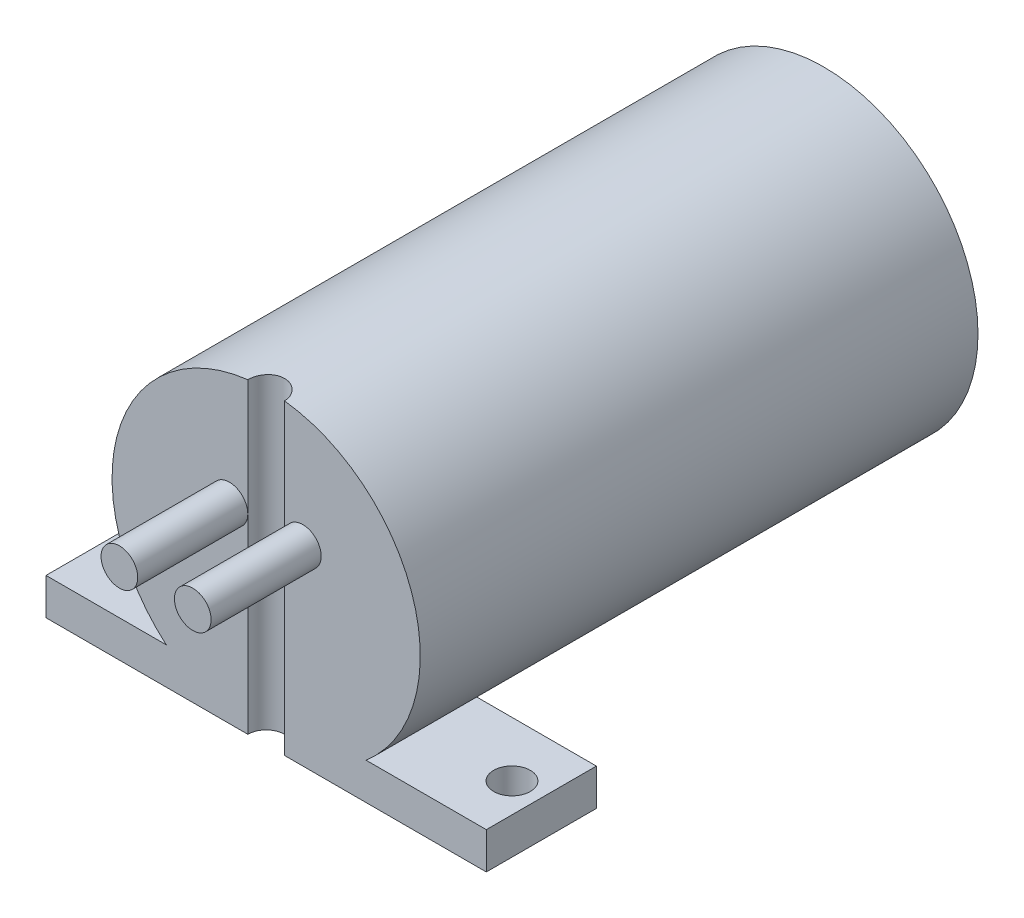
ISO-10303-21;
HEADER;
FILE_DESCRIPTION(('STEP AP214'),'2;1');
FILE_NAME('part.step','',(''),(''),'','','');
FILE_SCHEMA(('AUTOMOTIVE_DESIGN { 1 0 10303 214 1 1 1 1 }'));
ENDSEC;
DATA;
#1=APPLICATION_CONTEXT('core data for automotive mechanical design processes');
#2=APPLICATION_PROTOCOL_DEFINITION('international standard','automotive_design',2000,#1);
#3=PRODUCT_CONTEXT('',#1,'mechanical');
#4=PRODUCT('Part','Part','',(#3));
#5=PRODUCT_RELATED_PRODUCT_CATEGORY('part','',(#4));
#6=PRODUCT_DEFINITION_FORMATION('','',#4);
#7=PRODUCT_DEFINITION_CONTEXT('part definition',#1,'design');
#8=PRODUCT_DEFINITION('design','',#6,#7);
#9=PRODUCT_DEFINITION_SHAPE('','',#8);
#10=(LENGTH_UNIT() NAMED_UNIT(*) SI_UNIT(.MILLI.,.METRE.));
#11=(NAMED_UNIT(*) PLANE_ANGLE_UNIT() SI_UNIT($,.RADIAN.));
#12=(NAMED_UNIT(*) SI_UNIT($,.STERADIAN.) SOLID_ANGLE_UNIT());
#13=UNCERTAINTY_MEASURE_WITH_UNIT(LENGTH_MEASURE(1.E-05),#10,'distance_accuracy_value','');
#14=(GEOMETRIC_REPRESENTATION_CONTEXT(3) GLOBAL_UNCERTAINTY_ASSIGNED_CONTEXT((#13)) GLOBAL_UNIT_ASSIGNED_CONTEXT((#10,
#11,#12)) REPRESENTATION_CONTEXT('',''));
#15=CARTESIAN_POINT('',(0.,0.,0.));
#16=DIRECTION('',(0.,0.,1.));
#17=DIRECTION('',(1.,0.,0.));
#18=AXIS2_PLACEMENT_3D('',#15,#16,#17);
#19=CARTESIAN_POINT('',(0.,0.,48.26));
#20=DIRECTION('',(0.,0.,1.));
#21=DIRECTION('',(1.,0.,0.));
#22=AXIS2_PLACEMENT_3D('',#19,#20,#21);
#23=PLANE('',#22);
#24=DIRECTION('',(0.,-1.,0.));
#25=VECTOR('',#24,1.);
#26=CARTESIAN_POINT('',(-1.5875,-13.335,48.26));
#27=LINE('',#26,#25);
#28=CARTESIAN_POINT('',(-1.5875,3.175,48.26));
#29=VERTEX_POINT('',#28);
#30=CARTESIAN_POINT('',(-1.5875,-13.335,48.26));
#31=VERTEX_POINT('',#30);
#32=EDGE_CURVE('E126',#29,#31,#27,.T.);
#33=ORIENTED_EDGE('',*,*,#32,.F.);
#34=CARTESIAN_POINT('',(-3.175,3.175,48.26));
#35=DIRECTION('',(0.,0.,1.));
#36=DIRECTION('',(1.,0.,0.));
#37=AXIS2_PLACEMENT_3D('',#34,#35,#36);
#38=CIRCLE('',#37,1.5875);
#39=EDGE_CURVE('E66',#29,#29,#38,.T.);
#40=ORIENTED_EDGE('',*,*,#39,.F.);
#41=CARTESIAN_POINT('',(-1.5875,13.2401687583656,48.26));
#42=VERTEX_POINT('',#41);
#43=EDGE_CURVE('E214',#42,#29,#27,.T.);
#44=ORIENTED_EDGE('',*,*,#43,.F.);
#45=CARTESIAN_POINT('',(0.,0.,48.26));
#46=DIRECTION('',(0.,0.,1.));
#47=DIRECTION('',(1.,0.,0.));
#48=AXIS2_PLACEMENT_3D('',#45,#46,#47);
#49=CIRCLE('',#48,13.335);
#50=CARTESIAN_POINT('',(-8.63693377304701,-10.16,48.26));
#51=VERTEX_POINT('',#50);
#52=EDGE_CURVE('E178',#42,#51,#49,.T.);
#53=ORIENTED_EDGE('',*,*,#52,.T.);
#54=DIRECTION('',(-1.,0.,0.));
#55=VECTOR('',#54,1.);
#56=CARTESIAN_POINT('',(19.05,-10.16,48.26));
#57=LINE('',#56,#55);
#58=CARTESIAN_POINT('',(-19.05,-10.16,48.26));
#59=VERTEX_POINT('',#58);
#60=EDGE_CURVE('E211',#51,#59,#57,.T.);
#61=ORIENTED_EDGE('',*,*,#60,.T.);
#62=DIRECTION('',(0.,-1.,0.));
#63=VECTOR('',#62,1.);
#64=CARTESIAN_POINT('',(-19.05,-10.16,48.26));
#65=LINE('',#64,#63);
#66=CARTESIAN_POINT('',(-19.05,-13.335,48.26));
#67=VERTEX_POINT('',#66);
#68=EDGE_CURVE('E162',#59,#67,#65,.T.);
#69=ORIENTED_EDGE('',*,*,#68,.T.);
#70=DIRECTION('',(-1.,0.,0.));
#71=VECTOR('',#70,1.);
#72=CARTESIAN_POINT('',(19.05,-13.335,48.26));
#73=LINE('',#72,#71);
#74=EDGE_CURVE('E144',#31,#67,#73,.T.);
#75=ORIENTED_EDGE('',*,*,#74,.F.);
#76=EDGE_LOOP('',(#33,#40,#44,#53,#61,#69,#75));
#77=FACE_BOUND('',#76,.T.);
#78=ADVANCED_FACE('F42',(#77),#23,.T.);
#79=CARTESIAN_POINT('',(0.,0.,48.26));
#80=DIRECTION('',(0.,0.,-1.));
#81=DIRECTION('',(-1.,0.,0.));
#82=AXIS2_PLACEMENT_3D('',#79,#80,#81);
#83=CYLINDRICAL_SURFACE('',#82,13.335);
#84=CARTESIAN_POINT('',(0.,0.,0.));
#85=DIRECTION('',(0.,0.,1.));
#86=DIRECTION('',(1.,0.,0.));
#87=AXIS2_PLACEMENT_3D('',#84,#85,#86);
#88=CIRCLE('',#87,13.335);
#89=CARTESIAN_POINT('',(13.335,0.,0.));
#90=VERTEX_POINT('',#89);
#91=EDGE_CURVE('E173',#90,#90,#88,.T.);
#92=ORIENTED_EDGE('',*,*,#91,.T.);
#93=EDGE_LOOP('',(#92));
#94=FACE_BOUND('',#93,.T.);
#95=ORIENTED_EDGE('',*,*,#52,.F.);
#96=CARTESIAN_POINT('',(-1.5875,13.2401687583656,48.26));
#97=CARTESIAN_POINT('',(-1.58749989083105,13.2401674685661,48.2155057282806));
#98=CARTESIAN_POINT('',(-1.5856282009014,13.2403933321704,48.1710329281723));
#99=CARTESIAN_POINT('',(-1.57816250280456,13.2412857759808,48.0824086676028));
#100=CARTESIAN_POINT('',(-1.57256877106278,13.2419523234587,48.0382571835246));
#101=CARTESIAN_POINT('',(-1.55026333299539,13.2445893534873,47.9068571221025));
#102=CARTESIAN_POINT('',(-1.52802720167712,13.2471973238106,47.8204936604794));
#103=CARTESIAN_POINT('',(-1.46946299632564,13.2538206284328,47.6527601801473));
#104=CARTESIAN_POINT('',(-1.43312987558435,13.2578364666972,47.571391961827));
#105=CARTESIAN_POINT('',(-1.34741828469973,13.2668209661558,47.4159055459649));
#106=CARTESIAN_POINT('',(-1.29804152728852,13.2717895022297,47.3417863983126));
#107=CARTESIAN_POINT('',(-1.18738774473177,13.2821469538671,47.2025449805401));
#108=CARTESIAN_POINT('',(-1.12605983210618,13.2875376058939,47.1374632961336));
#109=CARTESIAN_POINT('',(-0.993327444953107,13.2981182551827,47.0184676334473));
#110=CARTESIAN_POINT('',(-0.921919201485522,13.3033081764647,46.9645578509275));
#111=CARTESIAN_POINT('',(-0.770783997254712,13.3129210064523,46.8692960262462));
#112=CARTESIAN_POINT('',(-0.691029569665693,13.3173412464321,46.8279873178981));
#113=CARTESIAN_POINT('',(-0.525714812640787,13.3248890126384,46.7594100599751));
#114=CARTESIAN_POINT('',(-0.440161403842763,13.3280180492601,46.7321250967856));
#115=CARTESIAN_POINT('',(-0.295119233540965,13.3318601705261,46.6990424226554));
#116=CARTESIAN_POINT('',(-0.236553688167421,13.333031979586,46.6891031397442));
#117=CARTESIAN_POINT('',(-0.118667266617829,13.3346023000691,46.675830605281));
#118=CARTESIAN_POINT('',(-0.0593463796710852,13.3350008004529,46.6724974480345));
#119=CARTESIAN_POINT('',(0.0888331150822678,13.3349988018355,46.6725038199304));
#120=CARTESIAN_POINT('',(0.177723348766857,13.3341029364165,46.6799815781257));
#121=CARTESIAN_POINT('',(0.353032014445846,13.3306153030461,46.7096951525648));
#122=CARTESIAN_POINT('',(0.439447734629815,13.3280217436518,46.7319465586325));
#123=CARTESIAN_POINT('',(0.607244076189092,13.3214310885218,46.7905442653409));
#124=CARTESIAN_POINT('',(0.688627989764798,13.3174349221591,46.8268812344913));
#125=CARTESIAN_POINT('',(0.844127603822901,13.3084840345293,46.9125998768801));
#126=CARTESIAN_POINT('',(0.918244482860676,13.3035294690826,46.9619794300799));
#127=CARTESIAN_POINT('',(1.05749034125783,13.2931878485457,47.0726439265578));
#128=CARTESIAN_POINT('',(1.12257789971178,13.2877989687185,47.1339808199378));
#129=CARTESIAN_POINT('',(1.24156392875665,13.2772106005854,47.2667130637143));
#130=CARTESIAN_POINT('',(1.29546140962365,13.2720111290655,47.3381093028885));
#131=CARTESIAN_POINT('',(1.39069782547778,13.262371257651,47.489208309109));
#132=CARTESIAN_POINT('',(1.43199490210773,13.2579334087616,47.568937605947));
#133=CARTESIAN_POINT('',(1.50057954170716,13.2503465641544,47.7342501066289));
#134=CARTESIAN_POINT('',(1.52787494379432,13.2471968474508,47.8198300044127));
#135=CARTESIAN_POINT('',(1.56096893001503,13.2433295522576,47.9649363651862));
#136=CARTESIAN_POINT('',(1.57091049358061,13.2421502067719,48.0235392030158));
#137=CARTESIAN_POINT('',(1.58417597724548,13.2405673548395,48.141419456559));
#138=CARTESIAN_POINT('',(1.58750875750055,13.2401628096711,48.2006958618031));
#139=CARTESIAN_POINT('',(1.5875,13.2401687583656,48.26));
#140=B_SPLINE_CURVE_WITH_KNOTS('',3,(#96,#97,#98,#99,#100,#101,#102,#103,#104,#105,#106,#107,
#108,#109,#110,#111,#112,#113,#114,#115,#116,#117,#118,#119,#120,#121,#122,#123,#124,#125,#126,
#127,#128,#129,#130,#131,#132,#133,#134,#135,#136,#137,#138,#139),.UNSPECIFIED.,.F.,.F.,(4,2,2,
2,2,2,2,2,2,2,2,2,2,2,2,2,2,2,2,2,2,4),(0.,0.133400329544741,0.266790752933609,
0.533070274071651,0.799445211100431,1.06578518837492,1.33328503665713,1.60088516681011,
1.86939543347101,2.13759071166709,2.31548243795509,2.49337670371433,2.75965919424282,
3.02622312569289,3.29261076321044,3.55895512672275,3.82648353693555,4.09403559904634,
4.36246702374168,4.63074799725293,4.80875070859316,4.98651461638341),.UNSPECIFIED.);
#141=CARTESIAN_POINT('',(1.5875,13.2401687583656,48.26));
#142=VERTEX_POINT('',#141);
#143=EDGE_CURVE('E11',#42,#142,#140,.T.);
#144=ORIENTED_EDGE('',*,*,#143,.T.);
#145=CARTESIAN_POINT('',(8.63693377304701,-10.16,48.26));
#146=VERTEX_POINT('',#145);
#147=EDGE_CURVE('E174',#146,#142,#49,.T.);
#148=ORIENTED_EDGE('',*,*,#147,.F.);
#149=DIRECTION('',(0.,0.,-1.));
#150=VECTOR('',#149,1.);
#151=CARTESIAN_POINT('',(8.63693377304701,-10.16,48.26));
#152=LINE('',#151,#150);
#153=CARTESIAN_POINT('',(8.63693377304701,-10.16,38.735));
#154=VERTEX_POINT('',#153);
#155=EDGE_CURVE('E159',#154,#146,#152,.F.);
#156=ORIENTED_EDGE('',*,*,#155,.F.);
#157=CARTESIAN_POINT('',(0.,0.,38.735));
#158=DIRECTION('',(0.,0.,-1.));
#159=DIRECTION('',(-1.,0.,0.));
#160=AXIS2_PLACEMENT_3D('',#157,#158,#159);
#161=CIRCLE('',#160,13.335);
#162=CARTESIAN_POINT('',(0.,-13.335,38.735));
#163=VERTEX_POINT('',#162);
#164=EDGE_CURVE('E56',#154,#163,#161,.T.);
#165=ORIENTED_EDGE('',*,*,#164,.T.);
#166=CARTESIAN_POINT('',(-8.63693377304701,-10.16,38.735));
#167=VERTEX_POINT('',#166);
#168=EDGE_CURVE('E177',#163,#167,#161,.T.);
#169=ORIENTED_EDGE('',*,*,#168,.T.);
#170=DIRECTION('',(0.,0.,-1.));
#171=VECTOR('',#170,1.);
#172=CARTESIAN_POINT('',(-8.63693377304701,-10.16,48.26));
#173=LINE('',#172,#171);
#174=EDGE_CURVE('E170',#51,#167,#173,.T.);
#175=ORIENTED_EDGE('',*,*,#174,.F.);
#176=EDGE_LOOP('',(#95,#144,#148,#156,#165,#169,#175));
#177=FACE_BOUND('',#176,.T.);
#178=ADVANCED_FACE('F44',(#94,#177),#83,.T.);
#179=DIRECTION('',(0.,-1.,0.));
#180=VECTOR('',#179,1.);
#181=CARTESIAN_POINT('',(1.5875,-13.335,48.26));
#182=LINE('',#181,#180);
#183=CARTESIAN_POINT('',(1.5875,3.175,48.26));
#184=VERTEX_POINT('',#183);
#185=EDGE_CURVE('E130',#184,#142,#182,.F.);
#186=ORIENTED_EDGE('',*,*,#185,.F.);
#187=CARTESIAN_POINT('',(3.175,3.175,48.26));
#188=DIRECTION('',(0.,0.,1.));
#189=DIRECTION('',(1.,0.,0.));
#190=AXIS2_PLACEMENT_3D('',#187,#188,#189);
#191=CIRCLE('',#190,1.5875);
#192=EDGE_CURVE('E61',#184,#184,#191,.T.);
#193=ORIENTED_EDGE('',*,*,#192,.F.);
#194=CARTESIAN_POINT('',(1.5875,-13.335,48.26));
#195=VERTEX_POINT('',#194);
#196=EDGE_CURVE('E124',#195,#184,#182,.F.);
#197=ORIENTED_EDGE('',*,*,#196,.F.);
#198=CARTESIAN_POINT('',(19.05,-13.335,48.26));
#199=VERTEX_POINT('',#198);
#200=EDGE_CURVE('E136',#199,#195,#73,.T.);
#201=ORIENTED_EDGE('',*,*,#200,.F.);
#202=DIRECTION('',(0.,-1.,0.));
#203=VECTOR('',#202,1.);
#204=CARTESIAN_POINT('',(19.05,-10.16,48.26));
#205=LINE('',#204,#203);
#206=CARTESIAN_POINT('',(19.05,-10.16,48.26));
#207=VERTEX_POINT('',#206);
#208=EDGE_CURVE('E165',#207,#199,#205,.T.);
#209=ORIENTED_EDGE('',*,*,#208,.F.);
#210=EDGE_CURVE('E205',#207,#146,#57,.T.);
#211=ORIENTED_EDGE('',*,*,#210,.T.);
#212=ORIENTED_EDGE('',*,*,#147,.T.);
#213=EDGE_LOOP('',(#186,#193,#197,#201,#209,#211,#212));
#214=FACE_BOUND('',#213,.T.);
#215=ADVANCED_FACE('F135',(#214),#23,.T.);
#216=CARTESIAN_POINT('',(0.,0.,0.));
#217=DIRECTION('',(0.,0.,1.));
#218=DIRECTION('',(1.,0.,0.));
#219=AXIS2_PLACEMENT_3D('',#216,#217,#218);
#220=PLANE('',#219);
#221=ORIENTED_EDGE('',*,*,#91,.F.);
#222=EDGE_LOOP('',(#221));
#223=FACE_BOUND('',#222,.T.);
#224=ADVANCED_FACE('F261',(#223),#220,.F.);
#225=CARTESIAN_POINT('',(19.05,-10.16,38.735));
#226=DIRECTION('',(0.,0.,-1.));
#227=DIRECTION('',(-1.,0.,0.));
#228=AXIS2_PLACEMENT_3D('',#225,#226,#227);
#229=PLANE('',#228);
#230=ORIENTED_EDGE('',*,*,#164,.F.);
#231=DIRECTION('',(1.,0.,0.));
#232=VECTOR('',#231,1.);
#233=CARTESIAN_POINT('',(19.05,-10.16,38.735));
#234=LINE('',#233,#232);
#235=CARTESIAN_POINT('',(19.05,-10.16,38.735));
#236=VERTEX_POINT('',#235);
#237=EDGE_CURVE('E204',#154,#236,#234,.T.);
#238=ORIENTED_EDGE('',*,*,#237,.T.);
#239=DIRECTION('',(0.,-1.,0.));
#240=VECTOR('',#239,1.);
#241=CARTESIAN_POINT('',(19.05,-10.16,38.735));
#242=LINE('',#241,#240);
#243=CARTESIAN_POINT('',(19.05,-13.335,38.735));
#244=VERTEX_POINT('',#243);
#245=EDGE_CURVE('E156',#236,#244,#242,.T.);
#246=ORIENTED_EDGE('',*,*,#245,.T.);
#247=DIRECTION('',(1.,0.,0.));
#248=VECTOR('',#247,1.);
#249=CARTESIAN_POINT('',(19.05,-13.335,38.735));
#250=LINE('',#249,#248);
#251=EDGE_CURVE('E147',#163,#244,#250,.T.);
#252=ORIENTED_EDGE('',*,*,#251,.F.);
#253=EDGE_LOOP('',(#230,#238,#246,#252));
#254=FACE_BOUND('',#253,.T.);
#255=ADVANCED_FACE('F193',(#254),#229,.T.);
#256=CARTESIAN_POINT('',(0.,-10.16,0.));
#257=DIRECTION('',(0.,-1.,0.));
#258=DIRECTION('',(0.,0.,-1.));
#259=AXIS2_PLACEMENT_3D('',#256,#257,#258);
#260=PLANE('',#259);
#261=CARTESIAN_POINT('',(-16.51,-10.16,43.4975));
#262=DIRECTION('',(0.,-1.,0.));
#263=DIRECTION('',(0.,0.,-1.));
#264=AXIS2_PLACEMENT_3D('',#261,#262,#263);
#265=CIRCLE('',#264,1.5875);
#266=CARTESIAN_POINT('',(-16.51,-10.16,41.91));
#267=VERTEX_POINT('',#266);
#268=EDGE_CURVE('E131',#267,#267,#265,.T.);
#269=ORIENTED_EDGE('',*,*,#268,.T.);
#270=EDGE_LOOP('',(#269));
#271=FACE_BOUND('',#270,.T.);
#272=ORIENTED_EDGE('',*,*,#60,.F.);
#273=ORIENTED_EDGE('',*,*,#174,.T.);
#274=CARTESIAN_POINT('',(-19.05,-10.16,38.735));
#275=VERTEX_POINT('',#274);
#276=EDGE_CURVE('E167',#275,#167,#234,.T.);
#277=ORIENTED_EDGE('',*,*,#276,.F.);
#278=DIRECTION('',(0.,0.,-1.));
#279=VECTOR('',#278,1.);
#280=CARTESIAN_POINT('',(-19.05,-10.16,38.735));
#281=LINE('',#280,#279);
#282=EDGE_CURVE('E201',#59,#275,#281,.T.);
#283=ORIENTED_EDGE('',*,*,#282,.F.);
#284=EDGE_LOOP('',(#272,#273,#277,#283));
#285=FACE_BOUND('',#284,.T.);
#286=ADVANCED_FACE('F207',(#271,#285),#260,.F.);
#287=CARTESIAN_POINT('',(16.51,-10.16,43.4975));
#288=DIRECTION('',(0.,-1.,0.));
#289=DIRECTION('',(0.,0.,-1.));
#290=AXIS2_PLACEMENT_3D('',#287,#288,#289);
#291=CIRCLE('',#290,1.5875);
#292=CARTESIAN_POINT('',(16.51,-10.16,41.91));
#293=VERTEX_POINT('',#292);
#294=EDGE_CURVE('E221',#293,#293,#291,.T.);
#295=ORIENTED_EDGE('',*,*,#294,.T.);
#296=EDGE_LOOP('',(#295));
#297=FACE_BOUND('',#296,.T.);
#298=ORIENTED_EDGE('',*,*,#237,.F.);
#299=ORIENTED_EDGE('',*,*,#155,.T.);
#300=ORIENTED_EDGE('',*,*,#210,.F.);
#301=DIRECTION('',(0.,0.,1.));
#302=VECTOR('',#301,1.);
#303=CARTESIAN_POINT('',(19.05,-10.16,38.735));
#304=LINE('',#303,#302);
#305=EDGE_CURVE('E155',#236,#207,#304,.T.);
#306=ORIENTED_EDGE('',*,*,#305,.F.);
#307=EDGE_LOOP('',(#298,#299,#300,#306));
#308=FACE_BOUND('',#307,.T.);
#309=ADVANCED_FACE('F276',(#297,#308),#260,.F.);
#310=CARTESIAN_POINT('',(0.,-13.335,0.));
#311=DIRECTION('',(0.,-1.,0.));
#312=DIRECTION('',(0.,0.,-1.));
#313=AXIS2_PLACEMENT_3D('',#310,#311,#312);
#314=PLANE('',#313);
#315=CARTESIAN_POINT('',(16.51,-13.335,43.4975));
#316=DIRECTION('',(0.,-1.,0.));
#317=DIRECTION('',(0.,0.,-1.));
#318=AXIS2_PLACEMENT_3D('',#315,#316,#317);
#319=CIRCLE('',#318,1.5875);
#320=CARTESIAN_POINT('',(16.51,-13.335,41.91));
#321=VERTEX_POINT('',#320);
#322=EDGE_CURVE('E224',#321,#321,#319,.T.);
#323=ORIENTED_EDGE('',*,*,#322,.F.);
#324=EDGE_LOOP('',(#323));
#325=FACE_BOUND('',#324,.T.);
#326=CARTESIAN_POINT('',(-16.51,-13.335,43.4975));
#327=DIRECTION('',(0.,-1.,0.));
#328=DIRECTION('',(0.,0.,-1.));
#329=AXIS2_PLACEMENT_3D('',#326,#327,#328);
#330=CIRCLE('',#329,1.5875);
#331=CARTESIAN_POINT('',(-16.51,-13.335,41.91));
#332=VERTEX_POINT('',#331);
#333=EDGE_CURVE('E218',#332,#332,#330,.T.);
#334=ORIENTED_EDGE('',*,*,#333,.F.);
#335=EDGE_LOOP('',(#334));
#336=FACE_BOUND('',#335,.T.);
#337=CARTESIAN_POINT('',(0.,-13.335,48.26));
#338=DIRECTION('',(0.,-1.,0.));
#339=DIRECTION('',(0.,0.,-1.));
#340=AXIS2_PLACEMENT_3D('',#337,#338,#339);
#341=CIRCLE('',#340,1.5875);
#342=EDGE_CURVE('E120',#31,#195,#341,.T.);
#343=ORIENTED_EDGE('',*,*,#342,.F.);
#344=ORIENTED_EDGE('',*,*,#74,.T.);
#345=DIRECTION('',(0.,0.,-1.));
#346=VECTOR('',#345,1.);
#347=CARTESIAN_POINT('',(-19.05,-13.335,38.735));
#348=LINE('',#347,#346);
#349=CARTESIAN_POINT('',(-19.05,-13.335,38.735));
#350=VERTEX_POINT('',#349);
#351=EDGE_CURVE('E143',#67,#350,#348,.T.);
#352=ORIENTED_EDGE('',*,*,#351,.T.);
#353=EDGE_CURVE('E152',#350,#163,#250,.T.);
#354=ORIENTED_EDGE('',*,*,#353,.T.);
#355=ORIENTED_EDGE('',*,*,#251,.T.);
#356=DIRECTION('',(0.,0.,1.));
#357=VECTOR('',#356,1.);
#358=CARTESIAN_POINT('',(19.05,-13.335,38.735));
#359=LINE('',#358,#357);
#360=EDGE_CURVE('E142',#244,#199,#359,.T.);
#361=ORIENTED_EDGE('',*,*,#360,.T.);
#362=ORIENTED_EDGE('',*,*,#200,.T.);
#363=EDGE_LOOP('',(#343,#344,#352,#354,#355,#361,#362));
#364=FACE_BOUND('',#363,.T.);
#365=ADVANCED_FACE('F140',(#325,#336,#364),#314,.T.);
#366=CARTESIAN_POINT('',(19.05,-10.16,38.735));
#367=DIRECTION('',(1.,0.,0.));
#368=DIRECTION('',(0.,0.,-1.));
#369=AXIS2_PLACEMENT_3D('',#366,#367,#368);
#370=PLANE('',#369);
#371=ORIENTED_EDGE('',*,*,#360,.F.);
#372=ORIENTED_EDGE('',*,*,#245,.F.);
#373=ORIENTED_EDGE('',*,*,#305,.T.);
#374=ORIENTED_EDGE('',*,*,#208,.T.);
#375=EDGE_LOOP('',(#371,#372,#373,#374));
#376=FACE_BOUND('',#375,.T.);
#377=ADVANCED_FACE('F282',(#376),#370,.T.);
#378=ORIENTED_EDGE('',*,*,#168,.F.);
#379=ORIENTED_EDGE('',*,*,#353,.F.);
#380=DIRECTION('',(0.,-1.,0.));
#381=VECTOR('',#380,1.);
#382=CARTESIAN_POINT('',(-19.05,-10.16,38.735));
#383=LINE('',#382,#381);
#384=EDGE_CURVE('E160',#275,#350,#383,.T.);
#385=ORIENTED_EDGE('',*,*,#384,.F.);
#386=ORIENTED_EDGE('',*,*,#276,.T.);
#387=EDGE_LOOP('',(#378,#379,#385,#386));
#388=FACE_BOUND('',#387,.T.);
#389=ADVANCED_FACE('F191',(#388),#229,.T.);
#390=CARTESIAN_POINT('',(-19.05,-10.16,38.735));
#391=DIRECTION('',(-1.,0.,0.));
#392=DIRECTION('',(0.,0.,1.));
#393=AXIS2_PLACEMENT_3D('',#390,#391,#392);
#394=PLANE('',#393);
#395=ORIENTED_EDGE('',*,*,#351,.F.);
#396=ORIENTED_EDGE('',*,*,#68,.F.);
#397=ORIENTED_EDGE('',*,*,#282,.T.);
#398=ORIENTED_EDGE('',*,*,#384,.T.);
#399=EDGE_LOOP('',(#395,#396,#397,#398));
#400=FACE_BOUND('',#399,.T.);
#401=ADVANCED_FACE('F198',(#400),#394,.T.);
#402=CARTESIAN_POINT('',(0.,-13.335,48.26));
#403=DIRECTION('',(0.,-1.,0.));
#404=DIRECTION('',(0.,0.,-1.));
#405=AXIS2_PLACEMENT_3D('',#402,#403,#404);
#406=CYLINDRICAL_SURFACE('',#405,1.5875);
#407=ORIENTED_EDGE('',*,*,#43,.T.);
#408=ORIENTED_EDGE('',*,*,#32,.T.);
#409=ORIENTED_EDGE('',*,*,#342,.T.);
#410=ORIENTED_EDGE('',*,*,#196,.T.);
#411=ORIENTED_EDGE('',*,*,#185,.T.);
#412=ORIENTED_EDGE('',*,*,#143,.F.);
#413=EDGE_LOOP('',(#407,#408,#409,#410,#411,#412));
#414=FACE_BOUND('',#413,.T.);
#415=ADVANCED_FACE('F123',(#414),#406,.F.);
#416=CARTESIAN_POINT('',(-16.51,-13.335,43.4975));
#417=DIRECTION('',(0.,-1.,0.));
#418=DIRECTION('',(0.,0.,-1.));
#419=AXIS2_PLACEMENT_3D('',#416,#417,#418);
#420=CYLINDRICAL_SURFACE('',#419,1.5875);
#421=ORIENTED_EDGE('',*,*,#333,.T.);
#422=EDGE_LOOP('',(#421));
#423=FACE_BOUND('',#422,.T.);
#424=ORIENTED_EDGE('',*,*,#268,.F.);
#425=EDGE_LOOP('',(#424));
#426=FACE_BOUND('',#425,.T.);
#427=ADVANCED_FACE('F300',(#423,#426),#420,.F.);
#428=CARTESIAN_POINT('',(16.51,-13.335,43.4975));
#429=DIRECTION('',(0.,-1.,0.));
#430=DIRECTION('',(0.,0.,-1.));
#431=AXIS2_PLACEMENT_3D('',#428,#429,#430);
#432=CYLINDRICAL_SURFACE('',#431,1.5875);
#433=ORIENTED_EDGE('',*,*,#322,.T.);
#434=EDGE_LOOP('',(#433));
#435=FACE_BOUND('',#434,.T.);
#436=ORIENTED_EDGE('',*,*,#294,.F.);
#437=EDGE_LOOP('',(#436));
#438=FACE_BOUND('',#437,.T.);
#439=ADVANCED_FACE('F303',(#435,#438),#432,.F.);
#440=CARTESIAN_POINT('',(3.175,3.175,57.785));
#441=DIRECTION('',(0.,0.,-1.));
#442=DIRECTION('',(-1.,0.,0.));
#443=AXIS2_PLACEMENT_3D('',#440,#441,#442);
#444=CYLINDRICAL_SURFACE('',#443,1.5875);
#445=CARTESIAN_POINT('',(3.175,3.175,57.785));
#446=DIRECTION('',(0.,0.,1.));
#447=DIRECTION('',(1.,0.,0.));
#448=AXIS2_PLACEMENT_3D('',#445,#446,#447);
#449=CIRCLE('',#448,1.5875);
#450=CARTESIAN_POINT('',(4.7625,3.175,57.785));
#451=VERTEX_POINT('',#450);
#452=EDGE_CURVE('E228',#451,#451,#449,.T.);
#453=ORIENTED_EDGE('',*,*,#452,.F.);
#454=EDGE_LOOP('',(#453));
#455=FACE_BOUND('',#454,.T.);
#456=ORIENTED_EDGE('',*,*,#192,.T.);
#457=EDGE_LOOP('',(#456));
#458=FACE_BOUND('',#457,.T.);
#459=ADVANCED_FACE('F247',(#455,#458),#444,.T.);
#460=CARTESIAN_POINT('',(3.175,3.175,57.785));
#461=DIRECTION('',(0.,0.,1.));
#462=DIRECTION('',(1.,0.,0.));
#463=AXIS2_PLACEMENT_3D('',#460,#461,#462);
#464=PLANE('',#463);
#465=ORIENTED_EDGE('',*,*,#452,.T.);
#466=EDGE_LOOP('',(#465));
#467=FACE_BOUND('',#466,.T.);
#468=ADVANCED_FACE('F240',(#467),#464,.T.);
#469=CARTESIAN_POINT('',(-3.175,3.175,57.785));
#470=DIRECTION('',(0.,0.,-1.));
#471=DIRECTION('',(-1.,0.,0.));
#472=AXIS2_PLACEMENT_3D('',#469,#470,#471);
#473=CYLINDRICAL_SURFACE('',#472,1.5875);
#474=CARTESIAN_POINT('',(-3.175,3.175,57.785));
#475=DIRECTION('',(0.,0.,1.));
#476=DIRECTION('',(1.,0.,0.));
#477=AXIS2_PLACEMENT_3D('',#474,#475,#476);
#478=CIRCLE('',#477,1.5875);
#479=CARTESIAN_POINT('',(-1.5875,3.175,57.785));
#480=VERTEX_POINT('',#479);
#481=EDGE_CURVE('E227',#480,#480,#478,.T.);
#482=ORIENTED_EDGE('',*,*,#481,.F.);
#483=EDGE_LOOP('',(#482));
#484=FACE_BOUND('',#483,.T.);
#485=ORIENTED_EDGE('',*,*,#39,.T.);
#486=EDGE_LOOP('',(#485));
#487=FACE_BOUND('',#486,.T.);
#488=ADVANCED_FACE('F238',(#484,#487),#473,.T.);
#489=CARTESIAN_POINT('',(-3.175,3.175,57.785));
#490=DIRECTION('',(0.,0.,1.));
#491=DIRECTION('',(1.,0.,0.));
#492=AXIS2_PLACEMENT_3D('',#489,#490,#491);
#493=PLANE('',#492);
#494=ORIENTED_EDGE('',*,*,#481,.T.);
#495=EDGE_LOOP('',(#494));
#496=FACE_BOUND('',#495,.T.);
#497=ADVANCED_FACE('F236',(#496),#493,.T.);
#498=CLOSED_SHELL('',(#78,#178,#215,#224,#255,#286,#309,#365,#377,#389,#401,#415,#427,#439,#459,
#468,#488,#497));
#499=MANIFOLD_SOLID_BREP('B2',#498);
#500=ADVANCED_BREP_SHAPE_REPRESENTATION('',(#18,#499),#14);
#501=SHAPE_DEFINITION_REPRESENTATION(#9,#500);
ENDSEC;
END-ISO-10303-21;
